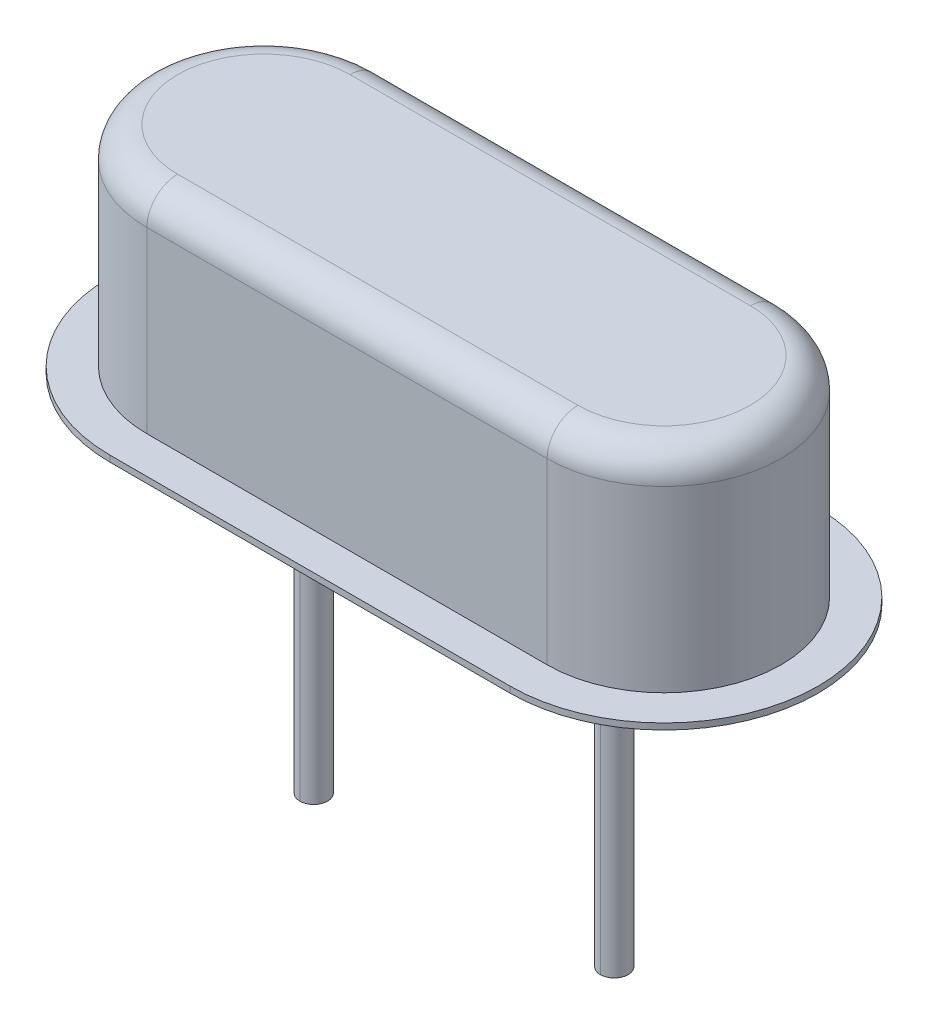
ISO-10303-21;
HEADER;
FILE_DESCRIPTION(('STEP AP214'),'2;1');
FILE_NAME('part.step','',(''),(''),'','','');
FILE_SCHEMA(('AUTOMOTIVE_DESIGN { 1 0 10303 214 1 1 1 1 }'));
ENDSEC;
DATA;
#1=APPLICATION_CONTEXT('core data for automotive mechanical design processes');
#2=APPLICATION_PROTOCOL_DEFINITION('international standard','automotive_design',2000,#1);
#3=PRODUCT_CONTEXT('',#1,'mechanical');
#4=PRODUCT('Part','Part','',(#3));
#5=PRODUCT_RELATED_PRODUCT_CATEGORY('part','',(#4));
#6=PRODUCT_DEFINITION_FORMATION('','',#4);
#7=PRODUCT_DEFINITION_CONTEXT('part definition',#1,'design');
#8=PRODUCT_DEFINITION('design','',#6,#7);
#9=PRODUCT_DEFINITION_SHAPE('','',#8);
#10=(LENGTH_UNIT() NAMED_UNIT(*) SI_UNIT(.MILLI.,.METRE.));
#11=(NAMED_UNIT(*) PLANE_ANGLE_UNIT() SI_UNIT($,.RADIAN.));
#12=(NAMED_UNIT(*) SI_UNIT($,.STERADIAN.) SOLID_ANGLE_UNIT());
#13=UNCERTAINTY_MEASURE_WITH_UNIT(LENGTH_MEASURE(1.E-05),#10,'distance_accuracy_value','');
#14=(GEOMETRIC_REPRESENTATION_CONTEXT(3) GLOBAL_UNCERTAINTY_ASSIGNED_CONTEXT((#13)) GLOBAL_UNIT_ASSIGNED_CONTEXT((#10,
#11,#12)) REPRESENTATION_CONTEXT('',''));
#15=CARTESIAN_POINT('',(0.,0.,0.));
#16=DIRECTION('',(0.,0.,1.));
#17=DIRECTION('',(1.,0.,0.));
#18=AXIS2_PLACEMENT_3D('',#15,#16,#17);
#19=CARTESIAN_POINT('',(2.44,-5.5,0.));
#20=DIRECTION('',(0.,-1.,0.));
#21=DIRECTION('',(0.,0.,-1.));
#22=AXIS2_PLACEMENT_3D('',#19,#20,#21);
#23=PLANE('',#22);
#24=CARTESIAN_POINT('',(2.44,-5.5,0.));
#25=DIRECTION('',(0.,-1.,0.));
#26=DIRECTION('',(0.,0.,-1.));
#27=AXIS2_PLACEMENT_3D('',#24,#25,#26);
#28=CIRCLE('',#27,0.225);
#29=CARTESIAN_POINT('',(2.44,-5.5,0.225));
#30=VERTEX_POINT('',#29);
#31=CARTESIAN_POINT('',(2.44,-5.5,-0.225));
#32=VERTEX_POINT('',#31);
#33=EDGE_CURVE('E11',#30,#32,#28,.T.);
#34=ORIENTED_EDGE('',*,*,#33,.T.);
#35=CARTESIAN_POINT('',(2.44,-5.5,0.));
#36=DIRECTION('',(0.,-1.,0.));
#37=DIRECTION('',(0.,0.,-1.));
#38=AXIS2_PLACEMENT_3D('',#35,#36,#37);
#39=CIRCLE('',#38,0.225);
#40=EDGE_CURVE('E376',#32,#30,#39,.T.);
#41=ORIENTED_EDGE('',*,*,#40,.T.);
#42=EDGE_LOOP('',(#34,#41));
#43=FACE_BOUND('',#42,.T.);
#44=ADVANCED_FACE('F17',(#43),#23,.T.);
#45=CARTESIAN_POINT('',(2.44,-5.5,0.));
#46=DIRECTION('',(0.,1.,0.));
#47=DIRECTION('',(0.,0.,1.));
#48=AXIS2_PLACEMENT_3D('',#45,#46,#47);
#49=CYLINDRICAL_SURFACE('',#48,0.225);
#50=DIRECTION('',(0.,1.,0.));
#51=VECTOR('',#50,1.);
#52=CARTESIAN_POINT('',(2.44,-5.5,-0.225));
#53=LINE('',#52,#51);
#54=CARTESIAN_POINT('',(2.44,0.,-0.225));
#55=VERTEX_POINT('',#54);
#56=EDGE_CURVE('E326',#32,#55,#53,.T.);
#57=ORIENTED_EDGE('',*,*,#56,.F.);
#58=ORIENTED_EDGE('',*,*,#33,.F.);
#59=DIRECTION('',(0.,1.,0.));
#60=VECTOR('',#59,1.);
#61=CARTESIAN_POINT('',(2.44,-5.5,0.225));
#62=LINE('',#61,#60);
#63=CARTESIAN_POINT('',(2.44,0.,0.225));
#64=VERTEX_POINT('',#63);
#65=EDGE_CURVE('E332',#30,#64,#62,.T.);
#66=ORIENTED_EDGE('',*,*,#65,.T.);
#67=CARTESIAN_POINT('',(2.44,0.,0.));
#68=DIRECTION('',(0.,-1.,0.));
#69=DIRECTION('',(0.,0.,1.));
#70=AXIS2_PLACEMENT_3D('',#67,#68,#69);
#71=CIRCLE('',#70,0.225);
#72=EDGE_CURVE('E222',#64,#55,#71,.T.);
#73=ORIENTED_EDGE('',*,*,#72,.T.);
#74=EDGE_LOOP('',(#57,#58,#66,#73));
#75=FACE_BOUND('',#74,.T.);
#76=ADVANCED_FACE('F365',(#75),#49,.T.);
#77=CARTESIAN_POINT('',(-2.44,-5.5,0.));
#78=DIRECTION('',(0.,-1.,0.));
#79=DIRECTION('',(0.,0.,-1.));
#80=AXIS2_PLACEMENT_3D('',#77,#78,#79);
#81=PLANE('',#80);
#82=CARTESIAN_POINT('',(-2.44,-5.5,0.));
#83=DIRECTION('',(0.,-1.,0.));
#84=DIRECTION('',(0.,0.,-1.));
#85=AXIS2_PLACEMENT_3D('',#82,#83,#84);
#86=CIRCLE('',#85,0.225);
#87=CARTESIAN_POINT('',(-2.44,-5.5,0.225));
#88=VERTEX_POINT('',#87);
#89=CARTESIAN_POINT('',(-2.44,-5.5,-0.225));
#90=VERTEX_POINT('',#89);
#91=EDGE_CURVE('E25',#88,#90,#86,.T.);
#92=ORIENTED_EDGE('',*,*,#91,.T.);
#93=CARTESIAN_POINT('',(-2.44,-5.5,0.));
#94=DIRECTION('',(0.,-1.,0.));
#95=DIRECTION('',(0.,0.,-1.));
#96=AXIS2_PLACEMENT_3D('',#93,#94,#95);
#97=CIRCLE('',#96,0.225);
#98=EDGE_CURVE('E336',#90,#88,#97,.T.);
#99=ORIENTED_EDGE('',*,*,#98,.T.);
#100=EDGE_LOOP('',(#92,#99));
#101=FACE_BOUND('',#100,.T.);
#102=ADVANCED_FACE('F370',(#101),#81,.T.);
#103=CARTESIAN_POINT('',(-2.44,-5.5,0.));
#104=DIRECTION('',(0.,1.,0.));
#105=DIRECTION('',(0.,0.,1.));
#106=AXIS2_PLACEMENT_3D('',#103,#104,#105);
#107=CYLINDRICAL_SURFACE('',#106,0.225);
#108=DIRECTION('',(0.,1.,0.));
#109=VECTOR('',#108,1.);
#110=CARTESIAN_POINT('',(-2.44,-5.5,-0.225));
#111=LINE('',#110,#109);
#112=CARTESIAN_POINT('',(-2.44,0.,-0.225));
#113=VERTEX_POINT('',#112);
#114=EDGE_CURVE('E340',#90,#113,#111,.T.);
#115=ORIENTED_EDGE('',*,*,#114,.F.);
#116=ORIENTED_EDGE('',*,*,#91,.F.);
#117=DIRECTION('',(0.,1.,0.));
#118=VECTOR('',#117,1.);
#119=CARTESIAN_POINT('',(-2.44,-5.5,0.225));
#120=LINE('',#119,#118);
#121=CARTESIAN_POINT('',(-2.44,0.,0.225));
#122=VERTEX_POINT('',#121);
#123=EDGE_CURVE('E182',#88,#122,#120,.T.);
#124=ORIENTED_EDGE('',*,*,#123,.T.);
#125=CARTESIAN_POINT('',(-2.44,0.,0.));
#126=DIRECTION('',(0.,-1.,0.));
#127=DIRECTION('',(0.,0.,1.));
#128=AXIS2_PLACEMENT_3D('',#125,#126,#127);
#129=CIRCLE('',#128,0.225);
#130=EDGE_CURVE('E225',#122,#113,#129,.T.);
#131=ORIENTED_EDGE('',*,*,#130,.T.);
#132=EDGE_LOOP('',(#115,#116,#124,#131));
#133=FACE_BOUND('',#132,.T.);
#134=ADVANCED_FACE('F629',(#133),#107,.T.);
#135=CARTESIAN_POINT('',(3.25,3.,0.));
#136=DIRECTION('',(0.,-1.,0.));
#137=DIRECTION('',(0.,0.,-1.));
#138=AXIS2_PLACEMENT_3D('',#135,#136,#137);
#139=TOROIDAL_SURFACE('',#138,1.4,0.5);
#140=CARTESIAN_POINT('',(3.25,3.,1.4));
#141=DIRECTION('',(1.,0.,0.));
#142=DIRECTION('',(0.,0.,-1.));
#143=AXIS2_PLACEMENT_3D('',#140,#141,#142);
#144=CIRCLE('',#143,0.5);
#145=CARTESIAN_POINT('',(3.25,3.5,1.4));
#146=VERTEX_POINT('',#145);
#147=CARTESIAN_POINT('',(3.25,3.,1.9));
#148=VERTEX_POINT('',#147);
#149=EDGE_CURVE('E286',#146,#148,#144,.T.);
#150=ORIENTED_EDGE('',*,*,#149,.T.);
#151=CARTESIAN_POINT('',(3.25,3.,0.));
#152=DIRECTION('',(0.,-1.,0.));
#153=DIRECTION('',(0.,0.,-1.));
#154=AXIS2_PLACEMENT_3D('',#151,#152,#153);
#155=CIRCLE('',#154,1.9);
#156=CARTESIAN_POINT('',(3.25,3.,-1.9));
#157=VERTEX_POINT('',#156);
#158=EDGE_CURVE('E260',#157,#148,#155,.T.);
#159=ORIENTED_EDGE('',*,*,#158,.F.);
#160=CARTESIAN_POINT('',(3.25,3.,-1.4));
#161=DIRECTION('',(1.,0.,0.));
#162=DIRECTION('',(0.,1.,0.));
#163=AXIS2_PLACEMENT_3D('',#160,#161,#162);
#164=CIRCLE('',#163,0.5);
#165=CARTESIAN_POINT('',(3.25,3.5,-1.4));
#166=VERTEX_POINT('',#165);
#167=EDGE_CURVE('E232',#157,#166,#164,.T.);
#168=ORIENTED_EDGE('',*,*,#167,.T.);
#169=CARTESIAN_POINT('',(3.25,3.5,0.));
#170=DIRECTION('',(0.,1.,0.));
#171=DIRECTION('',(0.,0.,-1.));
#172=AXIS2_PLACEMENT_3D('',#169,#170,#171);
#173=CIRCLE('',#172,1.4);
#174=EDGE_CURVE('E202',#146,#166,#173,.T.);
#175=ORIENTED_EDGE('',*,*,#174,.F.);
#176=EDGE_LOOP('',(#150,#159,#168,#175));
#177=FACE_BOUND('',#176,.T.);
#178=ADVANCED_FACE('F294',(#177),#139,.T.);
#179=CARTESIAN_POINT('',(3.25,3.,-1.4));
#180=DIRECTION('',(-1.,0.,0.));
#181=DIRECTION('',(0.,0.,1.));
#182=AXIS2_PLACEMENT_3D('',#179,#180,#181);
#183=CYLINDRICAL_SURFACE('',#182,0.5);
#184=CARTESIAN_POINT('',(-3.25,3.,-1.4));
#185=DIRECTION('',(1.,0.,0.));
#186=DIRECTION('',(0.,0.,-1.));
#187=AXIS2_PLACEMENT_3D('',#184,#185,#186);
#188=CIRCLE('',#187,0.5);
#189=CARTESIAN_POINT('',(-3.25,3.,-1.9));
#190=VERTEX_POINT('',#189);
#191=CARTESIAN_POINT('',(-3.25,3.5,-1.4));
#192=VERTEX_POINT('',#191);
#193=EDGE_CURVE('E47',#190,#192,#188,.T.);
#194=ORIENTED_EDGE('',*,*,#193,.T.);
#195=DIRECTION('',(-1.,0.,0.));
#196=VECTOR('',#195,1.);
#197=CARTESIAN_POINT('',(3.25,3.5,-1.4));
#198=LINE('',#197,#196);
#199=EDGE_CURVE('E197',#166,#192,#198,.T.);
#200=ORIENTED_EDGE('',*,*,#199,.F.);
#201=ORIENTED_EDGE('',*,*,#167,.F.);
#202=DIRECTION('',(1.,0.,0.));
#203=VECTOR('',#202,1.);
#204=CARTESIAN_POINT('',(-3.25,3.,-1.9));
#205=LINE('',#204,#203);
#206=EDGE_CURVE('E239',#190,#157,#205,.T.);
#207=ORIENTED_EDGE('',*,*,#206,.F.);
#208=EDGE_LOOP('',(#194,#200,#201,#207));
#209=FACE_BOUND('',#208,.T.);
#210=ADVANCED_FACE('F296',(#209),#183,.T.);
#211=CARTESIAN_POINT('',(3.25,3.,1.4));
#212=DIRECTION('',(1.,0.,0.));
#213=DIRECTION('',(0.,0.,-1.));
#214=AXIS2_PLACEMENT_3D('',#211,#212,#213);
#215=CYLINDRICAL_SURFACE('',#214,0.5);
#216=CARTESIAN_POINT('',(-3.25,3.,1.4));
#217=DIRECTION('',(1.,0.,0.));
#218=DIRECTION('',(0.,0.,-1.));
#219=AXIS2_PLACEMENT_3D('',#216,#217,#218);
#220=CIRCLE('',#219,0.5);
#221=CARTESIAN_POINT('',(-3.25,3.5,1.4));
#222=VERTEX_POINT('',#221);
#223=CARTESIAN_POINT('',(-3.25,3.,1.9));
#224=VERTEX_POINT('',#223);
#225=EDGE_CURVE('E37',#222,#224,#220,.T.);
#226=ORIENTED_EDGE('',*,*,#225,.T.);
#227=DIRECTION('',(-1.,0.,0.));
#228=VECTOR('',#227,1.);
#229=CARTESIAN_POINT('',(3.25,3.,1.9));
#230=LINE('',#229,#228);
#231=EDGE_CURVE('E218',#148,#224,#230,.T.);
#232=ORIENTED_EDGE('',*,*,#231,.F.);
#233=ORIENTED_EDGE('',*,*,#149,.F.);
#234=DIRECTION('',(1.,0.,0.));
#235=VECTOR('',#234,1.);
#236=CARTESIAN_POINT('',(3.25,3.5,1.4));
#237=LINE('',#236,#235);
#238=EDGE_CURVE('E280',#222,#146,#237,.T.);
#239=ORIENTED_EDGE('',*,*,#238,.F.);
#240=EDGE_LOOP('',(#226,#232,#233,#239));
#241=FACE_BOUND('',#240,.T.);
#242=ADVANCED_FACE('F300',(#241),#215,.T.);
#243=CARTESIAN_POINT('',(-3.25,3.,0.));
#244=DIRECTION('',(0.,-1.,0.));
#245=DIRECTION('',(0.,0.,-1.));
#246=AXIS2_PLACEMENT_3D('',#243,#244,#245);
#247=TOROIDAL_SURFACE('',#246,1.4,0.5);
#248=ORIENTED_EDGE('',*,*,#193,.F.);
#249=CARTESIAN_POINT('',(-3.25,3.,0.));
#250=DIRECTION('',(0.,-1.,0.));
#251=DIRECTION('',(0.,0.,-1.));
#252=AXIS2_PLACEMENT_3D('',#249,#250,#251);
#253=CIRCLE('',#252,1.9);
#254=EDGE_CURVE('E214',#224,#190,#253,.T.);
#255=ORIENTED_EDGE('',*,*,#254,.F.);
#256=ORIENTED_EDGE('',*,*,#225,.F.);
#257=CARTESIAN_POINT('',(-3.25,3.5,0.));
#258=DIRECTION('',(0.,1.,0.));
#259=DIRECTION('',(0.,0.,-1.));
#260=AXIS2_PLACEMENT_3D('',#257,#258,#259);
#261=CIRCLE('',#260,1.4);
#262=EDGE_CURVE('E201',#192,#222,#261,.T.);
#263=ORIENTED_EDGE('',*,*,#262,.F.);
#264=EDGE_LOOP('',(#248,#255,#256,#263));
#265=FACE_BOUND('',#264,.T.);
#266=ADVANCED_FACE('F319',(#265),#247,.T.);
#267=CARTESIAN_POINT('',(3.25,3.5,0.));
#268=DIRECTION('',(0.,-1.,0.));
#269=DIRECTION('',(0.,0.,-1.));
#270=AXIS2_PLACEMENT_3D('',#267,#268,#269);
#271=PLANE('',#270);
#272=ORIENTED_EDGE('',*,*,#174,.T.);
#273=ORIENTED_EDGE('',*,*,#199,.T.);
#274=ORIENTED_EDGE('',*,*,#262,.T.);
#275=ORIENTED_EDGE('',*,*,#238,.T.);
#276=EDGE_LOOP('',(#272,#273,#274,#275));
#277=FACE_BOUND('',#276,.T.);
#278=ADVANCED_FACE('F298',(#277),#271,.F.);
#279=CARTESIAN_POINT('',(3.25,3.5,1.9));
#280=DIRECTION('',(0.,0.,-1.));
#281=DIRECTION('',(0.,-1.,0.));
#282=AXIS2_PLACEMENT_3D('',#279,#280,#281);
#283=PLANE('',#282);
#284=DIRECTION('',(0.,-1.,0.));
#285=VECTOR('',#284,1.);
#286=CARTESIAN_POINT('',(3.25,3.5,1.9));
#287=LINE('',#286,#285);
#288=CARTESIAN_POINT('',(3.25,0.1,1.9));
#289=VERTEX_POINT('',#288);
#290=EDGE_CURVE('E240',#148,#289,#287,.T.);
#291=ORIENTED_EDGE('',*,*,#290,.F.);
#292=ORIENTED_EDGE('',*,*,#231,.T.);
#293=DIRECTION('',(0.,-1.,0.));
#294=VECTOR('',#293,1.);
#295=CARTESIAN_POINT('',(-3.25,3.5,1.9));
#296=LINE('',#295,#294);
#297=CARTESIAN_POINT('',(-3.25,0.1,1.9));
#298=VERTEX_POINT('',#297);
#299=EDGE_CURVE('E219',#224,#298,#296,.T.);
#300=ORIENTED_EDGE('',*,*,#299,.T.);
#301=DIRECTION('',(1.,0.,0.));
#302=VECTOR('',#301,1.);
#303=CARTESIAN_POINT('',(3.25,0.1,1.9));
#304=LINE('',#303,#302);
#305=EDGE_CURVE('E244',#298,#289,#304,.T.);
#306=ORIENTED_EDGE('',*,*,#305,.T.);
#307=EDGE_LOOP('',(#291,#292,#300,#306));
#308=FACE_BOUND('',#307,.T.);
#309=ADVANCED_FACE('F304',(#308),#283,.F.);
#310=CARTESIAN_POINT('',(-3.25,3.5,0.));
#311=DIRECTION('',(0.,-1.,0.));
#312=DIRECTION('',(0.,0.,-1.));
#313=AXIS2_PLACEMENT_3D('',#310,#311,#312);
#314=CYLINDRICAL_SURFACE('',#313,1.9);
#315=ORIENTED_EDGE('',*,*,#299,.F.);
#316=ORIENTED_EDGE('',*,*,#254,.T.);
#317=DIRECTION('',(0.,-1.,0.));
#318=VECTOR('',#317,1.);
#319=CARTESIAN_POINT('',(-3.25,3.5,-1.9));
#320=LINE('',#319,#318);
#321=CARTESIAN_POINT('',(-3.25,0.1,-1.9));
#322=VERTEX_POINT('',#321);
#323=EDGE_CURVE('E236',#190,#322,#320,.T.);
#324=ORIENTED_EDGE('',*,*,#323,.T.);
#325=CARTESIAN_POINT('',(-3.25,0.1,0.));
#326=DIRECTION('',(0.,1.,0.));
#327=DIRECTION('',(0.,0.,1.));
#328=AXIS2_PLACEMENT_3D('',#325,#326,#327);
#329=CIRCLE('',#328,1.9);
#330=EDGE_CURVE('E248',#322,#298,#329,.T.);
#331=ORIENTED_EDGE('',*,*,#330,.T.);
#332=EDGE_LOOP('',(#315,#316,#324,#331));
#333=FACE_BOUND('',#332,.T.);
#334=ADVANCED_FACE('F318',(#333),#314,.T.);
#335=CARTESIAN_POINT('',(-3.25,3.5,-1.9));
#336=DIRECTION('',(0.,0.,1.));
#337=DIRECTION('',(1.,0.,0.));
#338=AXIS2_PLACEMENT_3D('',#335,#336,#337);
#339=PLANE('',#338);
#340=ORIENTED_EDGE('',*,*,#323,.F.);
#341=ORIENTED_EDGE('',*,*,#206,.T.);
#342=DIRECTION('',(0.,-1.,0.));
#343=VECTOR('',#342,1.);
#344=CARTESIAN_POINT('',(3.25,3.5,-1.9));
#345=LINE('',#344,#343);
#346=CARTESIAN_POINT('',(3.25,0.1,-1.9));
#347=VERTEX_POINT('',#346);
#348=EDGE_CURVE('E257',#157,#347,#345,.T.);
#349=ORIENTED_EDGE('',*,*,#348,.T.);
#350=DIRECTION('',(-1.,0.,0.));
#351=VECTOR('',#350,1.);
#352=CARTESIAN_POINT('',(-3.25,0.1,-1.9));
#353=LINE('',#352,#351);
#354=EDGE_CURVE('E226',#347,#322,#353,.T.);
#355=ORIENTED_EDGE('',*,*,#354,.T.);
#356=EDGE_LOOP('',(#340,#341,#349,#355));
#357=FACE_BOUND('',#356,.T.);
#358=ADVANCED_FACE('F312',(#357),#339,.F.);
#359=CARTESIAN_POINT('',(3.25,3.5,0.));
#360=DIRECTION('',(0.,-1.,0.));
#361=DIRECTION('',(0.,0.,-1.));
#362=AXIS2_PLACEMENT_3D('',#359,#360,#361);
#363=CYLINDRICAL_SURFACE('',#362,1.9);
#364=ORIENTED_EDGE('',*,*,#348,.F.);
#365=ORIENTED_EDGE('',*,*,#158,.T.);
#366=ORIENTED_EDGE('',*,*,#290,.T.);
#367=CARTESIAN_POINT('',(3.25,0.1,0.));
#368=DIRECTION('',(0.,1.,0.));
#369=DIRECTION('',(0.,0.,-1.));
#370=AXIS2_PLACEMENT_3D('',#367,#368,#369);
#371=CIRCLE('',#370,1.9);
#372=EDGE_CURVE('E235',#289,#347,#371,.T.);
#373=ORIENTED_EDGE('',*,*,#372,.T.);
#374=EDGE_LOOP('',(#364,#365,#366,#373));
#375=FACE_BOUND('',#374,.T.);
#376=ADVANCED_FACE('F308',(#375),#363,.T.);
#377=CARTESIAN_POINT('',(-3.25,0.,0.));
#378=DIRECTION('',(0.,1.,0.));
#379=DIRECTION('',(1.,0.,0.));
#380=AXIS2_PLACEMENT_3D('',#377,#378,#379);
#381=PLANE('',#380);
#382=CARTESIAN_POINT('',(-3.25,0.,0.));
#383=DIRECTION('',(0.,1.,0.));
#384=DIRECTION('',(0.,0.,1.));
#385=AXIS2_PLACEMENT_3D('',#382,#383,#384);
#386=CIRCLE('',#385,2.5);
#387=CARTESIAN_POINT('',(-3.25,0.,-2.5));
#388=VERTEX_POINT('',#387);
#389=CARTESIAN_POINT('',(-3.25,0.,2.5));
#390=VERTEX_POINT('',#389);
#391=EDGE_CURVE('E170',#388,#390,#386,.T.);
#392=ORIENTED_EDGE('',*,*,#391,.F.);
#393=DIRECTION('',(-1.,0.,0.));
#394=VECTOR('',#393,1.);
#395=CARTESIAN_POINT('',(-3.25,0.,-2.5));
#396=LINE('',#395,#394);
#397=CARTESIAN_POINT('',(3.25,0.,-2.5));
#398=VERTEX_POINT('',#397);
#399=EDGE_CURVE('E152',#398,#388,#396,.T.);
#400=ORIENTED_EDGE('',*,*,#399,.F.);
#401=CARTESIAN_POINT('',(3.25,0.,0.));
#402=DIRECTION('',(0.,1.,0.));
#403=DIRECTION('',(0.,0.,-1.));
#404=AXIS2_PLACEMENT_3D('',#401,#402,#403);
#405=CIRCLE('',#404,2.5);
#406=CARTESIAN_POINT('',(3.25,0.,2.5));
#407=VERTEX_POINT('',#406);
#408=EDGE_CURVE('E211',#407,#398,#405,.T.);
#409=ORIENTED_EDGE('',*,*,#408,.F.);
#410=DIRECTION('',(1.,0.,0.));
#411=VECTOR('',#410,1.);
#412=CARTESIAN_POINT('',(-3.25,0.,2.5));
#413=LINE('',#412,#411);
#414=EDGE_CURVE('E174',#390,#407,#413,.T.);
#415=ORIENTED_EDGE('',*,*,#414,.F.);
#416=EDGE_LOOP('',(#392,#400,#409,#415));
#417=FACE_BOUND('',#416,.T.);
#418=ORIENTED_EDGE('',*,*,#130,.F.);
#419=CARTESIAN_POINT('',(-2.44,0.,0.));
#420=DIRECTION('',(0.,-1.,0.));
#421=DIRECTION('',(0.,0.,1.));
#422=AXIS2_PLACEMENT_3D('',#419,#420,#421);
#423=CIRCLE('',#422,0.225);
#424=EDGE_CURVE('E191',#113,#122,#423,.T.);
#425=ORIENTED_EDGE('',*,*,#424,.F.);
#426=EDGE_LOOP('',(#418,#425));
#427=FACE_BOUND('',#426,.T.);
#428=ORIENTED_EDGE('',*,*,#72,.F.);
#429=CARTESIAN_POINT('',(2.44,0.,0.));
#430=DIRECTION('',(0.,-1.,0.));
#431=DIRECTION('',(0.,0.,1.));
#432=AXIS2_PLACEMENT_3D('',#429,#430,#431);
#433=CIRCLE('',#432,0.225);
#434=EDGE_CURVE('E328',#55,#64,#433,.T.);
#435=ORIENTED_EDGE('',*,*,#434,.F.);
#436=EDGE_LOOP('',(#428,#435));
#437=FACE_BOUND('',#436,.T.);
#438=ADVANCED_FACE('F176',(#417,#427,#437),#381,.F.);
#439=CARTESIAN_POINT('',(-3.25,0.1,0.));
#440=DIRECTION('',(0.,1.,0.));
#441=DIRECTION('',(1.,0.,0.));
#442=AXIS2_PLACEMENT_3D('',#439,#440,#441);
#443=PLANE('',#442);
#444=CARTESIAN_POINT('',(-3.25,0.1,0.));
#445=DIRECTION('',(0.,1.,0.));
#446=DIRECTION('',(0.,0.,1.));
#447=AXIS2_PLACEMENT_3D('',#444,#445,#446);
#448=CIRCLE('',#447,2.5);
#449=CARTESIAN_POINT('',(-3.25,0.1,-2.5));
#450=VERTEX_POINT('',#449);
#451=CARTESIAN_POINT('',(-3.25,0.1,2.5));
#452=VERTEX_POINT('',#451);
#453=EDGE_CURVE('E172',#450,#452,#448,.T.);
#454=ORIENTED_EDGE('',*,*,#453,.T.);
#455=DIRECTION('',(1.,0.,0.));
#456=VECTOR('',#455,1.);
#457=CARTESIAN_POINT('',(-3.25,0.1,2.5));
#458=LINE('',#457,#456);
#459=CARTESIAN_POINT('',(3.25,0.1,2.5));
#460=VERTEX_POINT('',#459);
#461=EDGE_CURVE('E207',#452,#460,#458,.T.);
#462=ORIENTED_EDGE('',*,*,#461,.T.);
#463=CARTESIAN_POINT('',(3.25,0.1,0.));
#464=DIRECTION('',(0.,1.,0.));
#465=DIRECTION('',(0.,0.,-1.));
#466=AXIS2_PLACEMENT_3D('',#463,#464,#465);
#467=CIRCLE('',#466,2.5);
#468=CARTESIAN_POINT('',(3.25,0.1,-2.5));
#469=VERTEX_POINT('',#468);
#470=EDGE_CURVE('E164',#460,#469,#467,.T.);
#471=ORIENTED_EDGE('',*,*,#470,.T.);
#472=DIRECTION('',(-1.,0.,0.));
#473=VECTOR('',#472,1.);
#474=CARTESIAN_POINT('',(-3.25,0.1,-2.5));
#475=LINE('',#474,#473);
#476=EDGE_CURVE('E163',#469,#450,#475,.T.);
#477=ORIENTED_EDGE('',*,*,#476,.T.);
#478=EDGE_LOOP('',(#454,#462,#471,#477));
#479=FACE_BOUND('',#478,.T.);
#480=ORIENTED_EDGE('',*,*,#372,.F.);
#481=ORIENTED_EDGE('',*,*,#305,.F.);
#482=ORIENTED_EDGE('',*,*,#330,.F.);
#483=ORIENTED_EDGE('',*,*,#354,.F.);
#484=EDGE_LOOP('',(#480,#481,#482,#483));
#485=FACE_BOUND('',#484,.T.);
#486=ADVANCED_FACE('F315',(#479,#485),#443,.T.);
#487=CARTESIAN_POINT('',(-3.25,0.1,-2.5));
#488=DIRECTION('',(0.,0.,1.));
#489=DIRECTION('',(1.,0.,0.));
#490=AXIS2_PLACEMENT_3D('',#487,#488,#489);
#491=PLANE('',#490);
#492=ORIENTED_EDGE('',*,*,#399,.T.);
#493=DIRECTION('',(0.,-1.,0.));
#494=VECTOR('',#493,1.);
#495=CARTESIAN_POINT('',(-3.25,0.1,-2.5));
#496=LINE('',#495,#494);
#497=EDGE_CURVE('E155',#450,#388,#496,.T.);
#498=ORIENTED_EDGE('',*,*,#497,.F.);
#499=ORIENTED_EDGE('',*,*,#476,.F.);
#500=DIRECTION('',(0.,-1.,0.));
#501=VECTOR('',#500,1.);
#502=CARTESIAN_POINT('',(3.25,0.1,-2.5));
#503=LINE('',#502,#501);
#504=EDGE_CURVE('E158',#469,#398,#503,.T.);
#505=ORIENTED_EDGE('',*,*,#504,.T.);
#506=EDGE_LOOP('',(#492,#498,#499,#505));
#507=FACE_BOUND('',#506,.T.);
#508=ADVANCED_FACE('F154',(#507),#491,.F.);
#509=CARTESIAN_POINT('',(3.25,0.1,0.));
#510=DIRECTION('',(0.,-1.,0.));
#511=DIRECTION('',(0.,0.,-1.));
#512=AXIS2_PLACEMENT_3D('',#509,#510,#511);
#513=CYLINDRICAL_SURFACE('',#512,2.5);
#514=ORIENTED_EDGE('',*,*,#408,.T.);
#515=ORIENTED_EDGE('',*,*,#504,.F.);
#516=ORIENTED_EDGE('',*,*,#470,.F.);
#517=DIRECTION('',(0.,-1.,0.));
#518=VECTOR('',#517,1.);
#519=CARTESIAN_POINT('',(3.25,0.1,2.5));
#520=LINE('',#519,#518);
#521=EDGE_CURVE('E203',#460,#407,#520,.T.);
#522=ORIENTED_EDGE('',*,*,#521,.T.);
#523=EDGE_LOOP('',(#514,#515,#516,#522));
#524=FACE_BOUND('',#523,.T.);
#525=ADVANCED_FACE('F352',(#524),#513,.T.);
#526=CARTESIAN_POINT('',(-3.25,0.1,2.5));
#527=DIRECTION('',(0.,0.,-1.));
#528=DIRECTION('',(0.,-1.,0.));
#529=AXIS2_PLACEMENT_3D('',#526,#527,#528);
#530=PLANE('',#529);
#531=ORIENTED_EDGE('',*,*,#414,.T.);
#532=ORIENTED_EDGE('',*,*,#521,.F.);
#533=ORIENTED_EDGE('',*,*,#461,.F.);
#534=DIRECTION('',(0.,-1.,0.));
#535=VECTOR('',#534,1.);
#536=CARTESIAN_POINT('',(-3.25,0.1,2.5));
#537=LINE('',#536,#535);
#538=EDGE_CURVE('E181',#452,#390,#537,.T.);
#539=ORIENTED_EDGE('',*,*,#538,.T.);
#540=EDGE_LOOP('',(#531,#532,#533,#539));
#541=FACE_BOUND('',#540,.T.);
#542=ADVANCED_FACE('F349',(#541),#530,.F.);
#543=CARTESIAN_POINT('',(-3.25,0.1,0.));
#544=DIRECTION('',(0.,-1.,0.));
#545=DIRECTION('',(0.,0.,-1.));
#546=AXIS2_PLACEMENT_3D('',#543,#544,#545);
#547=CYLINDRICAL_SURFACE('',#546,2.5);
#548=ORIENTED_EDGE('',*,*,#391,.T.);
#549=ORIENTED_EDGE('',*,*,#538,.F.);
#550=ORIENTED_EDGE('',*,*,#453,.F.);
#551=ORIENTED_EDGE('',*,*,#497,.T.);
#552=EDGE_LOOP('',(#548,#549,#550,#551));
#553=FACE_BOUND('',#552,.T.);
#554=ADVANCED_FACE('F168',(#553),#547,.T.);
#555=CARTESIAN_POINT('',(-2.44,-5.5,0.));
#556=DIRECTION('',(0.,1.,0.));
#557=DIRECTION('',(0.,0.,1.));
#558=AXIS2_PLACEMENT_3D('',#555,#556,#557);
#559=CYLINDRICAL_SURFACE('',#558,0.225);
#560=ORIENTED_EDGE('',*,*,#98,.F.);
#561=ORIENTED_EDGE('',*,*,#114,.T.);
#562=ORIENTED_EDGE('',*,*,#424,.T.);
#563=ORIENTED_EDGE('',*,*,#123,.F.);
#564=EDGE_LOOP('',(#560,#561,#562,#563));
#565=FACE_BOUND('',#564,.T.);
#566=ADVANCED_FACE('F524',(#565),#559,.T.);
#567=CARTESIAN_POINT('',(2.44,-5.5,0.));
#568=DIRECTION('',(0.,1.,0.));
#569=DIRECTION('',(0.,0.,1.));
#570=AXIS2_PLACEMENT_3D('',#567,#568,#569);
#571=CYLINDRICAL_SURFACE('',#570,0.225);
#572=ORIENTED_EDGE('',*,*,#40,.F.);
#573=ORIENTED_EDGE('',*,*,#56,.T.);
#574=ORIENTED_EDGE('',*,*,#434,.T.);
#575=ORIENTED_EDGE('',*,*,#65,.F.);
#576=EDGE_LOOP('',(#572,#573,#574,#575));
#577=FACE_BOUND('',#576,.T.);
#578=ADVANCED_FACE('F382',(#577),#571,.T.);
#579=CLOSED_SHELL('',(#44,#76,#102,#134,#178,#210,#242,#266,#278,#309,#334,#358,#376,#438,#486,
#508,#525,#542,#554,#566,#578));
#580=MANIFOLD_SOLID_BREP('B1',#579);
#581=ADVANCED_BREP_SHAPE_REPRESENTATION('',(#18,#580),#14);
#582=SHAPE_DEFINITION_REPRESENTATION(#9,#581);
ENDSEC;
END-ISO-10303-21;
